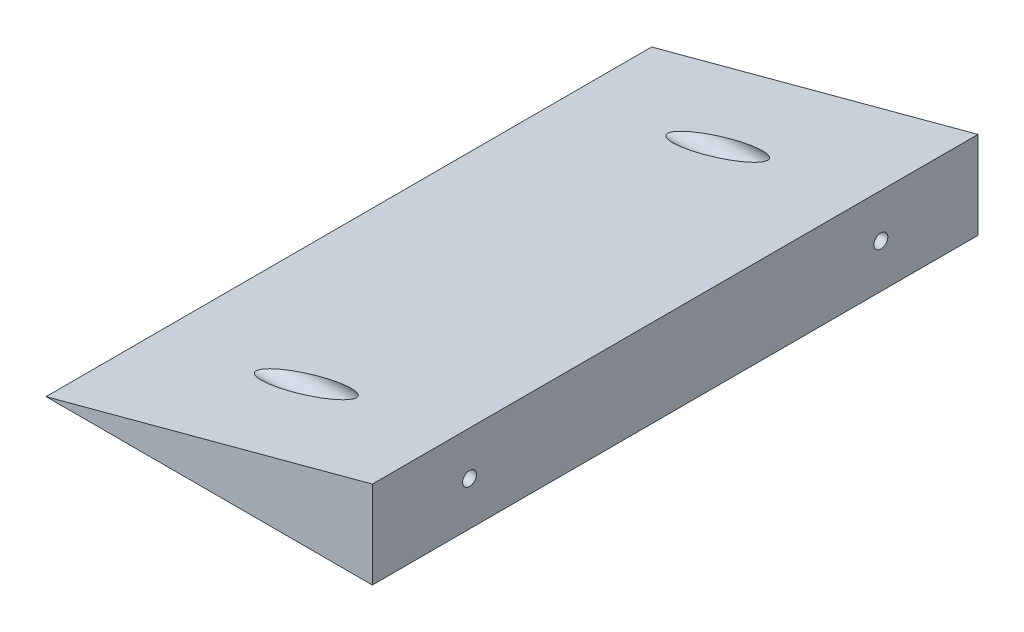
ISO-10303-21;
HEADER;
FILE_DESCRIPTION(('STEP AP214'),'2;1');
FILE_NAME('part.step','',(''),(''),'','','');
FILE_SCHEMA(('AUTOMOTIVE_DESIGN { 1 0 10303 214 1 1 1 1 }'));
ENDSEC;
DATA;
#1=APPLICATION_CONTEXT('core data for automotive mechanical design processes');
#2=APPLICATION_PROTOCOL_DEFINITION('international standard','automotive_design',2000,#1);
#3=PRODUCT_CONTEXT('',#1,'mechanical');
#4=PRODUCT('Part','Part','',(#3));
#5=PRODUCT_RELATED_PRODUCT_CATEGORY('part','',(#4));
#6=PRODUCT_DEFINITION_FORMATION('','',#4);
#7=PRODUCT_DEFINITION_CONTEXT('part definition',#1,'design');
#8=PRODUCT_DEFINITION('design','',#6,#7);
#9=PRODUCT_DEFINITION_SHAPE('','',#8);
#10=(LENGTH_UNIT() NAMED_UNIT(*) SI_UNIT(.MILLI.,.METRE.));
#11=(NAMED_UNIT(*) PLANE_ANGLE_UNIT() SI_UNIT($,.RADIAN.));
#12=(NAMED_UNIT(*) SI_UNIT($,.STERADIAN.) SOLID_ANGLE_UNIT());
#13=UNCERTAINTY_MEASURE_WITH_UNIT(LENGTH_MEASURE(1.E-05),#10,'distance_accuracy_value','');
#14=(GEOMETRIC_REPRESENTATION_CONTEXT(3) GLOBAL_UNCERTAINTY_ASSIGNED_CONTEXT((#13)) GLOBAL_UNIT_ASSIGNED_CONTEXT((#10,
#11,#12)) REPRESENTATION_CONTEXT('',''));
#15=CARTESIAN_POINT('',(0.,0.,0.));
#16=DIRECTION('',(0.,0.,1.));
#17=DIRECTION('',(1.,0.,0.));
#18=AXIS2_PLACEMENT_3D('',#15,#16,#17);
#19=CARTESIAN_POINT('',(0.,0.,187.));
#20=DIRECTION('',(0.,1.,0.));
#21=DIRECTION('',(-1.,0.,0.));
#22=AXIS2_PLACEMENT_3D('',#19,#20,#21);
#23=PLANE('',#22);
#24=DIRECTION('',(1.,0.,0.));
#25=VECTOR('',#24,1.);
#26=CARTESIAN_POINT('',(0.,0.,0.));
#27=LINE('',#26,#25);
#28=CARTESIAN_POINT('',(-100.765371804358,0.,0.));
#29=VERTEX_POINT('',#28);
#30=CARTESIAN_POINT('',(0.,0.,0.));
#31=VERTEX_POINT('',#30);
#32=EDGE_CURVE('E91',#29,#31,#27,.T.);
#33=ORIENTED_EDGE('',*,*,#32,.T.);
#34=DIRECTION('',(0.,0.,-1.));
#35=VECTOR('',#34,1.);
#36=CARTESIAN_POINT('',(0.,0.,187.));
#37=LINE('',#36,#35);
#38=CARTESIAN_POINT('',(0.,0.,187.));
#39=VERTEX_POINT('',#38);
#40=EDGE_CURVE('E11',#39,#31,#37,.T.);
#41=ORIENTED_EDGE('',*,*,#40,.F.);
#42=DIRECTION('',(1.,0.,0.));
#43=VECTOR('',#42,1.);
#44=CARTESIAN_POINT('',(0.,0.,187.));
#45=LINE('',#44,#43);
#46=CARTESIAN_POINT('',(-100.765371804358,0.,187.));
#47=VERTEX_POINT('',#46);
#48=EDGE_CURVE('E83',#47,#39,#45,.T.);
#49=ORIENTED_EDGE('',*,*,#48,.F.);
#50=DIRECTION('',(0.,0.,-1.));
#51=VECTOR('',#50,1.);
#52=CARTESIAN_POINT('',(-100.765371804358,0.,187.));
#53=LINE('',#52,#51);
#54=EDGE_CURVE('E92',#47,#29,#53,.T.);
#55=ORIENTED_EDGE('',*,*,#54,.T.);
#56=EDGE_LOOP('',(#33,#41,#49,#55));
#57=FACE_BOUND('',#56,.T.);
#58=ADVANCED_FACE('F39',(#57),#23,.F.);
#59=CARTESIAN_POINT('',(0.,0.,187.));
#60=DIRECTION('',(-1.,0.,0.));
#61=DIRECTION('',(0.,0.,1.));
#62=AXIS2_PLACEMENT_3D('',#59,#60,#61);
#63=PLANE('',#62);
#64=CARTESIAN_POINT('',(0.,13.5,30.));
#65=DIRECTION('',(1.,0.,0.));
#66=DIRECTION('',(0.,0.,-1.));
#67=AXIS2_PLACEMENT_3D('',#64,#65,#66);
#68=CIRCLE('',#67,2.15);
#69=CARTESIAN_POINT('',(0.,13.5,27.85));
#70=VERTEX_POINT('',#69);
#71=EDGE_CURVE('E95',#70,#70,#68,.T.);
#72=ORIENTED_EDGE('',*,*,#71,.F.);
#73=EDGE_LOOP('',(#72));
#74=FACE_BOUND('',#73,.T.);
#75=CARTESIAN_POINT('',(0.,13.5,157.));
#76=DIRECTION('',(1.,0.,0.));
#77=DIRECTION('',(0.,0.,-1.));
#78=AXIS2_PLACEMENT_3D('',#75,#76,#77);
#79=CIRCLE('',#78,2.15000000000002);
#80=CARTESIAN_POINT('',(0.,13.5,154.85));
#81=VERTEX_POINT('',#80);
#82=EDGE_CURVE('E101',#81,#81,#79,.T.);
#83=ORIENTED_EDGE('',*,*,#82,.F.);
#84=EDGE_LOOP('',(#83));
#85=FACE_BOUND('',#84,.T.);
#86=DIRECTION('',(0.,1.,0.));
#87=VECTOR('',#86,1.);
#88=CARTESIAN_POINT('',(0.,0.,0.));
#89=LINE('',#88,#87);
#90=CARTESIAN_POINT('',(0.,27.,0.));
#91=VERTEX_POINT('',#90);
#92=EDGE_CURVE('E70',#31,#91,#89,.T.);
#93=ORIENTED_EDGE('',*,*,#92,.T.);
#94=DIRECTION('',(0.,0.,-1.));
#95=VECTOR('',#94,1.);
#96=CARTESIAN_POINT('',(0.,27.,187.));
#97=LINE('',#96,#95);
#98=CARTESIAN_POINT('',(0.,27.,187.));
#99=VERTEX_POINT('',#98);
#100=EDGE_CURVE('E49',#99,#91,#97,.T.);
#101=ORIENTED_EDGE('',*,*,#100,.F.);
#102=DIRECTION('',(0.,1.,0.));
#103=VECTOR('',#102,1.);
#104=CARTESIAN_POINT('',(0.,0.,187.));
#105=LINE('',#104,#103);
#106=EDGE_CURVE('E78',#39,#99,#105,.T.);
#107=ORIENTED_EDGE('',*,*,#106,.F.);
#108=ORIENTED_EDGE('',*,*,#40,.T.);
#109=EDGE_LOOP('',(#93,#101,#107,#108));
#110=FACE_BOUND('',#109,.T.);
#111=ADVANCED_FACE('F79',(#74,#85,#110),#63,.F.);
#112=CARTESIAN_POINT('',(0.,27.,187.));
#113=DIRECTION('',(0.258819045102525,-0.965925826289067,0.));
#114=DIRECTION('',(0.965925826289067,0.258819045102525,0.));
#115=AXIS2_PLACEMENT_3D('',#112,#113,#114);
#116=PLANE('',#115);
#117=CARTESIAN_POINT('',(-50.382685902179,13.5,30.));
#118=DIRECTION('',(0.258819045102525,-0.965925826289067,0.));
#119=DIRECTION('',(-0.965925826289067,-0.258819045102525,0.));
#120=AXIS2_PLACEMENT_3D('',#117,#118,#119);
#121=ELLIPSE('',#120,16.0343687163983,4.15);
#122=CARTESIAN_POINT('',(-65.8706967535896,9.35,30.));
#123=VERTEX_POINT('',#122);
#124=EDGE_CURVE('E42',#123,#123,#121,.F.);
#125=ORIENTED_EDGE('',*,*,#124,.F.);
#126=EDGE_LOOP('',(#125));
#127=FACE_BOUND('',#126,.T.);
#128=CARTESIAN_POINT('',(-50.382685902179,13.5,157.));
#129=DIRECTION('',(0.258819045102525,-0.965925826289067,0.));
#130=DIRECTION('',(-0.965925826289067,-0.258819045102525,0.));
#131=AXIS2_PLACEMENT_3D('',#128,#129,#130);
#132=ELLIPSE('',#131,16.0343687163983,4.15000000000001);
#133=CARTESIAN_POINT('',(-65.8706967535896,9.34999999999999,157.));
#134=VERTEX_POINT('',#133);
#135=EDGE_CURVE('E119',#134,#134,#132,.F.);
#136=ORIENTED_EDGE('',*,*,#135,.F.);
#137=EDGE_LOOP('',(#136));
#138=FACE_BOUND('',#137,.T.);
#139=DIRECTION('',(-0.965925826289067,-0.258819045102525,0.));
#140=VECTOR('',#139,1.);
#141=CARTESIAN_POINT('',(0.,27.,0.));
#142=LINE('',#141,#140);
#143=EDGE_CURVE('E75',#91,#29,#142,.T.);
#144=ORIENTED_EDGE('',*,*,#143,.T.);
#145=ORIENTED_EDGE('',*,*,#54,.F.);
#146=DIRECTION('',(-0.965925826289067,-0.258819045102525,0.));
#147=VECTOR('',#146,1.);
#148=CARTESIAN_POINT('',(0.,27.,187.));
#149=LINE('',#148,#147);
#150=EDGE_CURVE('E58',#99,#47,#149,.T.);
#151=ORIENTED_EDGE('',*,*,#150,.F.);
#152=ORIENTED_EDGE('',*,*,#100,.T.);
#153=EDGE_LOOP('',(#144,#145,#151,#152));
#154=FACE_BOUND('',#153,.T.);
#155=ADVANCED_FACE('F160',(#127,#138,#154),#116,.F.);
#156=CARTESIAN_POINT('',(0.,0.,187.));
#157=DIRECTION('',(0.,0.,-1.));
#158=DIRECTION('',(-1.,0.,0.));
#159=AXIS2_PLACEMENT_3D('',#156,#157,#158);
#160=PLANE('',#159);
#161=ORIENTED_EDGE('',*,*,#48,.T.);
#162=ORIENTED_EDGE('',*,*,#106,.T.);
#163=ORIENTED_EDGE('',*,*,#150,.T.);
#164=EDGE_LOOP('',(#161,#162,#163));
#165=FACE_BOUND('',#164,.T.);
#166=ADVANCED_FACE('F86',(#165),#160,.F.);
#167=CARTESIAN_POINT('',(0.,0.,0.));
#168=DIRECTION('',(0.,0.,-1.));
#169=DIRECTION('',(-1.,0.,0.));
#170=AXIS2_PLACEMENT_3D('',#167,#168,#169);
#171=PLANE('',#170);
#172=ORIENTED_EDGE('',*,*,#32,.F.);
#173=ORIENTED_EDGE('',*,*,#143,.F.);
#174=ORIENTED_EDGE('',*,*,#92,.F.);
#175=EDGE_LOOP('',(#172,#173,#174));
#176=FACE_BOUND('',#175,.T.);
#177=ADVANCED_FACE('F168',(#176),#171,.T.);
#178=CARTESIAN_POINT('',(-100.765371804358,13.5,157.));
#179=DIRECTION('',(1.,0.,0.));
#180=DIRECTION('',(0.,0.,-1.));
#181=AXIS2_PLACEMENT_3D('',#178,#179,#180);
#182=CYLINDRICAL_SURFACE('',#181,2.15000000000002);
#183=CARTESIAN_POINT('',(-25.,13.5,157.));
#184=DIRECTION('',(1.,0.,0.));
#185=DIRECTION('',(0.,0.,-1.));
#186=AXIS2_PLACEMENT_3D('',#183,#184,#185);
#187=CIRCLE('',#186,2.15000000000002);
#188=CARTESIAN_POINT('',(-25.,13.5,154.85));
#189=VERTEX_POINT('',#188);
#190=EDGE_CURVE('E115',#189,#189,#187,.F.);
#191=ORIENTED_EDGE('',*,*,#190,.T.);
#192=EDGE_LOOP('',(#191));
#193=FACE_BOUND('',#192,.T.);
#194=ORIENTED_EDGE('',*,*,#82,.T.);
#195=EDGE_LOOP('',(#194));
#196=FACE_BOUND('',#195,.T.);
#197=ADVANCED_FACE('F154',(#193,#196),#182,.F.);
#198=CARTESIAN_POINT('',(-100.765371804358,13.5,30.));
#199=DIRECTION('',(1.,0.,0.));
#200=DIRECTION('',(0.,0.,-1.));
#201=AXIS2_PLACEMENT_3D('',#198,#199,#200);
#202=CYLINDRICAL_SURFACE('',#201,2.15);
#203=CARTESIAN_POINT('',(-25.,13.5,30.));
#204=DIRECTION('',(1.,0.,0.));
#205=DIRECTION('',(0.,0.,-1.));
#206=AXIS2_PLACEMENT_3D('',#203,#204,#205);
#207=CIRCLE('',#206,2.15);
#208=CARTESIAN_POINT('',(-25.,13.5,27.85));
#209=VERTEX_POINT('',#208);
#210=EDGE_CURVE('E111',#209,#209,#207,.F.);
#211=ORIENTED_EDGE('',*,*,#210,.T.);
#212=EDGE_LOOP('',(#211));
#213=FACE_BOUND('',#212,.T.);
#214=ORIENTED_EDGE('',*,*,#71,.T.);
#215=EDGE_LOOP('',(#214));
#216=FACE_BOUND('',#215,.T.);
#217=ADVANCED_FACE('F151',(#213,#216),#202,.F.);
#218=CARTESIAN_POINT('',(-25.,13.5,30.));
#219=DIRECTION('',(-1.,0.,0.));
#220=DIRECTION('',(0.,0.,1.));
#221=AXIS2_PLACEMENT_3D('',#218,#219,#220);
#222=CYLINDRICAL_SURFACE('',#221,4.15);
#223=CARTESIAN_POINT('',(-25.,13.5,30.));
#224=DIRECTION('',(1.,0.,0.));
#225=DIRECTION('',(0.,0.,-1.));
#226=AXIS2_PLACEMENT_3D('',#223,#224,#225);
#227=CIRCLE('',#226,4.15);
#228=CARTESIAN_POINT('',(-25.,13.5,25.85));
#229=VERTEX_POINT('',#228);
#230=EDGE_CURVE('E116',#229,#229,#227,.T.);
#231=ORIENTED_EDGE('',*,*,#230,.T.);
#232=EDGE_LOOP('',(#231));
#233=FACE_BOUND('',#232,.T.);
#234=ORIENTED_EDGE('',*,*,#124,.T.);
#235=EDGE_LOOP('',(#234));
#236=FACE_BOUND('',#235,.T.);
#237=ADVANCED_FACE('F142',(#233,#236),#222,.F.);
#238=CARTESIAN_POINT('',(-25.,13.5,30.));
#239=DIRECTION('',(1.,0.,0.));
#240=DIRECTION('',(0.,0.,-1.));
#241=AXIS2_PLACEMENT_3D('',#238,#239,#240);
#242=PLANE('',#241);
#243=ORIENTED_EDGE('',*,*,#230,.F.);
#244=EDGE_LOOP('',(#243));
#245=FACE_BOUND('',#244,.T.);
#246=ORIENTED_EDGE('',*,*,#210,.F.);
#247=EDGE_LOOP('',(#246));
#248=FACE_BOUND('',#247,.T.);
#249=ADVANCED_FACE('F144',(#245,#248),#242,.F.);
#250=CARTESIAN_POINT('',(-25.,13.5,157.));
#251=DIRECTION('',(-1.,0.,0.));
#252=DIRECTION('',(0.,0.,1.));
#253=AXIS2_PLACEMENT_3D('',#250,#251,#252);
#254=CYLINDRICAL_SURFACE('',#253,4.15000000000001);
#255=CARTESIAN_POINT('',(-25.,13.5,157.));
#256=DIRECTION('',(1.,0.,0.));
#257=DIRECTION('',(0.,0.,-1.));
#258=AXIS2_PLACEMENT_3D('',#255,#256,#257);
#259=CIRCLE('',#258,4.15000000000001);
#260=CARTESIAN_POINT('',(-25.,13.5,152.85));
#261=VERTEX_POINT('',#260);
#262=EDGE_CURVE('E134',#261,#261,#259,.T.);
#263=ORIENTED_EDGE('',*,*,#262,.T.);
#264=EDGE_LOOP('',(#263));
#265=FACE_BOUND('',#264,.T.);
#266=ORIENTED_EDGE('',*,*,#135,.T.);
#267=EDGE_LOOP('',(#266));
#268=FACE_BOUND('',#267,.T.);
#269=ADVANCED_FACE('F147',(#265,#268),#254,.F.);
#270=CARTESIAN_POINT('',(-25.,13.5,157.));
#271=DIRECTION('',(1.,0.,0.));
#272=DIRECTION('',(0.,0.,-1.));
#273=AXIS2_PLACEMENT_3D('',#270,#271,#272);
#274=PLANE('',#273);
#275=ORIENTED_EDGE('',*,*,#262,.F.);
#276=EDGE_LOOP('',(#275));
#277=FACE_BOUND('',#276,.T.);
#278=ORIENTED_EDGE('',*,*,#190,.F.);
#279=EDGE_LOOP('',(#278));
#280=FACE_BOUND('',#279,.T.);
#281=ADVANCED_FACE('F178',(#277,#280),#274,.F.);
#282=CLOSED_SHELL('',(#58,#111,#155,#166,#177,#197,#217,#237,#249,#269,#281));
#283=MANIFOLD_SOLID_BREP('B2',#282);
#284=ADVANCED_BREP_SHAPE_REPRESENTATION('',(#18,#283),#14);
#285=SHAPE_DEFINITION_REPRESENTATION(#9,#284);
ENDSEC;
END-ISO-10303-21;
